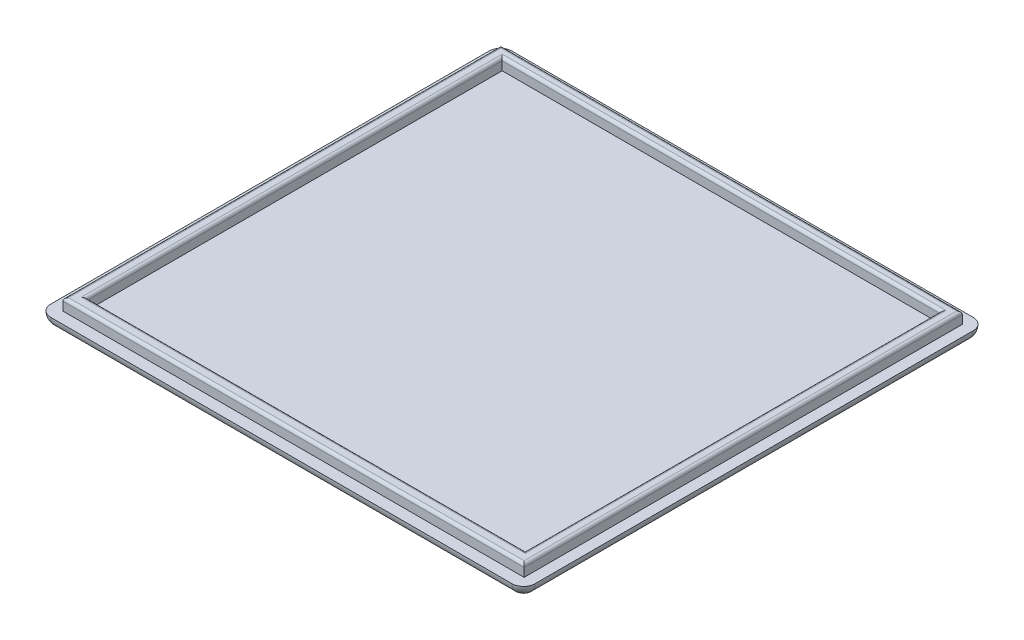
ISO-10303-21;
HEADER;
FILE_DESCRIPTION(('STEP AP214'),'2;1');
FILE_NAME('part.step','',(''),(''),'','','');
FILE_SCHEMA(('AUTOMOTIVE_DESIGN { 1 0 10303 214 1 1 1 1 }'));
ENDSEC;
DATA;
#1=APPLICATION_CONTEXT('core data for automotive mechanical design processes');
#2=APPLICATION_PROTOCOL_DEFINITION('international standard','automotive_design',2000,#1);
#3=PRODUCT_CONTEXT('',#1,'mechanical');
#4=PRODUCT('Part','Part','',(#3));
#5=PRODUCT_RELATED_PRODUCT_CATEGORY('part','',(#4));
#6=PRODUCT_DEFINITION_FORMATION('','',#4);
#7=PRODUCT_DEFINITION_CONTEXT('part definition',#1,'design');
#8=PRODUCT_DEFINITION('design','',#6,#7);
#9=PRODUCT_DEFINITION_SHAPE('','',#8);
#10=(LENGTH_UNIT() NAMED_UNIT(*) SI_UNIT(.MILLI.,.METRE.));
#11=(NAMED_UNIT(*) PLANE_ANGLE_UNIT() SI_UNIT($,.RADIAN.));
#12=(NAMED_UNIT(*) SI_UNIT($,.STERADIAN.) SOLID_ANGLE_UNIT());
#13=UNCERTAINTY_MEASURE_WITH_UNIT(LENGTH_MEASURE(1.E-05),#10,'distance_accuracy_value','');
#14=(GEOMETRIC_REPRESENTATION_CONTEXT(3) GLOBAL_UNCERTAINTY_ASSIGNED_CONTEXT((#13)) GLOBAL_UNIT_ASSIGNED_CONTEXT((#10,
#11,#12)) REPRESENTATION_CONTEXT('',''));
#15=CARTESIAN_POINT('',(0.,0.,0.));
#16=DIRECTION('',(0.,0.,1.));
#17=DIRECTION('',(1.,0.,0.));
#18=AXIS2_PLACEMENT_3D('',#15,#16,#17);
#19=CARTESIAN_POINT('',(0.,2.,0.));
#20=DIRECTION('',(0.,-1.,0.));
#21=DIRECTION('',(0.,0.,-1.));
#22=AXIS2_PLACEMENT_3D('',#19,#20,#21);
#23=PLANE('',#22);
#24=DIRECTION('',(0.,0.,-1.));
#25=VECTOR('',#24,1.);
#26=CARTESIAN_POINT('',(84.,2.,0.));
#27=LINE('',#26,#25);
#28=CARTESIAN_POINT('',(84.,2.,-2.));
#29=VERTEX_POINT('',#28);
#30=CARTESIAN_POINT('',(84.,2.,-78.));
#31=VERTEX_POINT('',#30);
#32=EDGE_CURVE('E249',#29,#31,#27,.T.);
#33=ORIENTED_EDGE('',*,*,#32,.T.);
#34=CARTESIAN_POINT('',(82.,2.,-78.));
#35=DIRECTION('',(0.,-1.,0.));
#36=DIRECTION('',(0.,0.,-1.));
#37=AXIS2_PLACEMENT_3D('',#34,#35,#36);
#38=CIRCLE('',#37,2.);
#39=CARTESIAN_POINT('',(82.,2.,-80.));
#40=VERTEX_POINT('',#39);
#41=EDGE_CURVE('E265',#31,#40,#38,.F.);
#42=ORIENTED_EDGE('',*,*,#41,.T.);
#43=DIRECTION('',(-1.,0.,0.));
#44=VECTOR('',#43,1.);
#45=CARTESIAN_POINT('',(0.,2.,-80.));
#46=LINE('',#45,#44);
#47=CARTESIAN_POINT('',(2.,2.,-80.));
#48=VERTEX_POINT('',#47);
#49=EDGE_CURVE('E252',#40,#48,#46,.T.);
#50=ORIENTED_EDGE('',*,*,#49,.T.);
#51=CARTESIAN_POINT('',(2.,2.,-78.));
#52=DIRECTION('',(0.,-1.,0.));
#53=DIRECTION('',(0.,0.,-1.));
#54=AXIS2_PLACEMENT_3D('',#51,#52,#53);
#55=CIRCLE('',#54,2.);
#56=CARTESIAN_POINT('',(0.,2.,-78.));
#57=VERTEX_POINT('',#56);
#58=EDGE_CURVE('E255',#48,#57,#55,.F.);
#59=ORIENTED_EDGE('',*,*,#58,.T.);
#60=DIRECTION('',(0.,0.,1.));
#61=VECTOR('',#60,1.);
#62=CARTESIAN_POINT('',(0.,2.,0.));
#63=LINE('',#62,#61);
#64=CARTESIAN_POINT('',(0.,2.,-2.));
#65=VERTEX_POINT('',#64);
#66=EDGE_CURVE('E243',#57,#65,#63,.T.);
#67=ORIENTED_EDGE('',*,*,#66,.T.);
#68=CARTESIAN_POINT('',(2.,2.,-2.));
#69=DIRECTION('',(0.,-1.,0.));
#70=DIRECTION('',(0.,0.,-1.));
#71=AXIS2_PLACEMENT_3D('',#68,#69,#70);
#72=CIRCLE('',#71,2.);
#73=CARTESIAN_POINT('',(2.,2.,0.));
#74=VERTEX_POINT('',#73);
#75=EDGE_CURVE('E258',#65,#74,#72,.F.);
#76=ORIENTED_EDGE('',*,*,#75,.T.);
#77=DIRECTION('',(1.,0.,0.));
#78=VECTOR('',#77,1.);
#79=CARTESIAN_POINT('',(0.,2.,0.));
#80=LINE('',#79,#78);
#81=CARTESIAN_POINT('',(82.,2.,0.));
#82=VERTEX_POINT('',#81);
#83=EDGE_CURVE('E246',#74,#82,#80,.T.);
#84=ORIENTED_EDGE('',*,*,#83,.T.);
#85=CARTESIAN_POINT('',(82.,2.,-2.));
#86=DIRECTION('',(0.,-1.,0.));
#87=DIRECTION('',(0.,0.,-1.));
#88=AXIS2_PLACEMENT_3D('',#85,#86,#87);
#89=CIRCLE('',#88,2.);
#90=EDGE_CURVE('E262',#82,#29,#89,.F.);
#91=ORIENTED_EDGE('',*,*,#90,.T.);
#92=EDGE_LOOP('',(#33,#42,#50,#59,#67,#76,#84,#91));
#93=FACE_BOUND('',#92,.T.);
#94=DIRECTION('',(1.,0.,0.));
#95=VECTOR('',#94,1.);
#96=CARTESIAN_POINT('',(0.,2.,-2.));
#97=LINE('',#96,#95);
#98=CARTESIAN_POINT('',(2.1,2.,-2.));
#99=VERTEX_POINT('',#98);
#100=CARTESIAN_POINT('',(82.1,2.,-2.));
#101=VERTEX_POINT('',#100);
#102=EDGE_CURVE('E181',#99,#101,#97,.T.);
#103=ORIENTED_EDGE('',*,*,#102,.F.);
#104=DIRECTION('',(0.,0.,1.));
#105=VECTOR('',#104,1.);
#106=CARTESIAN_POINT('',(2.1,2.,0.));
#107=LINE('',#106,#105);
#108=CARTESIAN_POINT('',(2.1,2.,-78.));
#109=VERTEX_POINT('',#108);
#110=EDGE_CURVE('E227',#109,#99,#107,.T.);
#111=ORIENTED_EDGE('',*,*,#110,.F.);
#112=DIRECTION('',(-1.,0.,0.));
#113=VECTOR('',#112,1.);
#114=CARTESIAN_POINT('',(0.,2.,-78.));
#115=LINE('',#114,#113);
#116=CARTESIAN_POINT('',(82.1,2.,-78.));
#117=VERTEX_POINT('',#116);
#118=EDGE_CURVE('E223',#117,#109,#115,.T.);
#119=ORIENTED_EDGE('',*,*,#118,.F.);
#120=DIRECTION('',(0.,0.,-1.));
#121=VECTOR('',#120,1.);
#122=CARTESIAN_POINT('',(82.1,2.,0.));
#123=LINE('',#122,#121);
#124=EDGE_CURVE('E219',#101,#117,#123,.T.);
#125=ORIENTED_EDGE('',*,*,#124,.F.);
#126=EDGE_LOOP('',(#103,#111,#119,#125));
#127=FACE_BOUND('',#126,.T.);
#128=ADVANCED_FACE('F41',(#93,#127),#23,.F.);
#129=CARTESIAN_POINT('',(0.,0.,0.));
#130=DIRECTION('',(0.,-1.,0.));
#131=DIRECTION('',(0.,0.,-1.));
#132=AXIS2_PLACEMENT_3D('',#129,#130,#131);
#133=PLANE('',#132);
#134=DIRECTION('',(-1.,0.,0.));
#135=VECTOR('',#134,1.);
#136=CARTESIAN_POINT('',(82.,0.,-78.));
#137=LINE('',#136,#135);
#138=CARTESIAN_POINT('',(2.,0.,-78.));
#139=VERTEX_POINT('',#138);
#140=CARTESIAN_POINT('',(82.,0.,-78.));
#141=VERTEX_POINT('',#140);
#142=EDGE_CURVE('E274',#139,#141,#137,.F.);
#143=ORIENTED_EDGE('',*,*,#142,.T.);
#144=DIRECTION('',(0.,0.,-1.));
#145=VECTOR('',#144,1.);
#146=CARTESIAN_POINT('',(82.,0.,-2.));
#147=LINE('',#146,#145);
#148=CARTESIAN_POINT('',(82.,0.,-2.));
#149=VERTEX_POINT('',#148);
#150=EDGE_CURVE('E277',#141,#149,#147,.F.);
#151=ORIENTED_EDGE('',*,*,#150,.T.);
#152=DIRECTION('',(1.,0.,0.));
#153=VECTOR('',#152,1.);
#154=CARTESIAN_POINT('',(2.,0.,-2.));
#155=LINE('',#154,#153);
#156=CARTESIAN_POINT('',(2.,0.,-2.));
#157=VERTEX_POINT('',#156);
#158=EDGE_CURVE('E268',#149,#157,#155,.F.);
#159=ORIENTED_EDGE('',*,*,#158,.T.);
#160=DIRECTION('',(0.,0.,1.));
#161=VECTOR('',#160,1.);
#162=CARTESIAN_POINT('',(2.,0.,-78.));
#163=LINE('',#162,#161);
#164=EDGE_CURVE('E271',#157,#139,#163,.F.);
#165=ORIENTED_EDGE('',*,*,#164,.T.);
#166=EDGE_LOOP('',(#143,#151,#159,#165));
#167=FACE_BOUND('',#166,.T.);
#168=ADVANCED_FACE('F408',(#167),#133,.T.);
#169=CARTESIAN_POINT('',(0.,4.,0.));
#170=DIRECTION('',(0.,1.,0.));
#171=DIRECTION('',(0.,0.,1.));
#172=AXIS2_PLACEMENT_3D('',#169,#170,#171);
#173=PLANE('',#172);
#174=DIRECTION('',(0.,0.,1.));
#175=VECTOR('',#174,1.);
#176=CARTESIAN_POINT('',(2.6,4.,-2.));
#177=LINE('',#176,#175);
#178=CARTESIAN_POINT('',(2.6,4.,-77.5));
#179=VERTEX_POINT('',#178);
#180=CARTESIAN_POINT('',(2.6,4.,-2.5));
#181=VERTEX_POINT('',#180);
#182=EDGE_CURVE('E321',#179,#181,#177,.T.);
#183=ORIENTED_EDGE('',*,*,#182,.T.);
#184=DIRECTION('',(1.,0.,0.));
#185=VECTOR('',#184,1.);
#186=CARTESIAN_POINT('',(82.1,4.,-2.5));
#187=LINE('',#186,#185);
#188=CARTESIAN_POINT('',(81.6,4.,-2.5));
#189=VERTEX_POINT('',#188);
#190=EDGE_CURVE('E330',#181,#189,#187,.T.);
#191=ORIENTED_EDGE('',*,*,#190,.T.);
#192=DIRECTION('',(0.,0.,-1.));
#193=VECTOR('',#192,1.);
#194=CARTESIAN_POINT('',(81.6,4.,-78.));
#195=LINE('',#194,#193);
#196=CARTESIAN_POINT('',(81.6,4.,-77.5));
#197=VERTEX_POINT('',#196);
#198=EDGE_CURVE('E327',#189,#197,#195,.T.);
#199=ORIENTED_EDGE('',*,*,#198,.T.);
#200=DIRECTION('',(-1.,0.,0.));
#201=VECTOR('',#200,1.);
#202=CARTESIAN_POINT('',(2.1,4.,-77.5));
#203=LINE('',#202,#201);
#204=EDGE_CURVE('E324',#197,#179,#203,.T.);
#205=ORIENTED_EDGE('',*,*,#204,.T.);
#206=EDGE_LOOP('',(#183,#191,#199,#205));
#207=FACE_BOUND('',#206,.T.);
#208=DIRECTION('',(0.,0.,-1.));
#209=VECTOR('',#208,1.);
#210=CARTESIAN_POINT('',(80.6061346638942,4.,0.));
#211=LINE('',#210,#209);
#212=CARTESIAN_POINT('',(80.6061346638942,4.,-76.6904761904762));
#213=VERTEX_POINT('',#212);
#214=CARTESIAN_POINT('',(80.6061346638942,4.,-3.69047619047621));
#215=VERTEX_POINT('',#214);
#216=EDGE_CURVE('E314',#213,#215,#211,.F.);
#217=ORIENTED_EDGE('',*,*,#216,.T.);
#218=DIRECTION('',(1.,0.,0.));
#219=VECTOR('',#218,1.);
#220=CARTESIAN_POINT('',(0.,4.,-3.69047619047621));
#221=LINE('',#220,#219);
#222=CARTESIAN_POINT('',(3.60613466389421,4.,-3.69047619047621));
#223=VERTEX_POINT('',#222);
#224=EDGE_CURVE('E317',#215,#223,#221,.F.);
#225=ORIENTED_EDGE('',*,*,#224,.T.);
#226=DIRECTION('',(0.,0.,1.));
#227=VECTOR('',#226,1.);
#228=CARTESIAN_POINT('',(3.60613466389421,4.,0.));
#229=LINE('',#228,#227);
#230=CARTESIAN_POINT('',(3.60613466389421,4.,-76.6904761904762));
#231=VERTEX_POINT('',#230);
#232=EDGE_CURVE('E281',#223,#231,#229,.F.);
#233=ORIENTED_EDGE('',*,*,#232,.T.);
#234=DIRECTION('',(-1.,0.,0.));
#235=VECTOR('',#234,1.);
#236=CARTESIAN_POINT('',(0.,4.,-76.6904761904762));
#237=LINE('',#236,#235);
#238=EDGE_CURVE('E311',#231,#213,#237,.F.);
#239=ORIENTED_EDGE('',*,*,#238,.T.);
#240=EDGE_LOOP('',(#217,#225,#233,#239));
#241=FACE_BOUND('',#240,.T.);
#242=ADVANCED_FACE('F389',(#207,#241),#173,.T.);
#243=CARTESIAN_POINT('',(0.,4.,-2.));
#244=DIRECTION('',(0.,0.,-1.));
#245=DIRECTION('',(-1.,0.,0.));
#246=AXIS2_PLACEMENT_3D('',#243,#244,#245);
#247=PLANE('',#246);
#248=DIRECTION('',(0.,-1.,0.));
#249=VECTOR('',#248,1.);
#250=CARTESIAN_POINT('',(82.1,4.,-2.));
#251=LINE('',#250,#249);
#252=CARTESIAN_POINT('',(82.1,3.5,-2.));
#253=VERTEX_POINT('',#252);
#254=EDGE_CURVE('E240',#253,#101,#251,.T.);
#255=ORIENTED_EDGE('',*,*,#254,.F.);
#256=DIRECTION('',(1.,0.,0.));
#257=VECTOR('',#256,1.);
#258=CARTESIAN_POINT('',(2.1,3.5,-2.));
#259=LINE('',#258,#257);
#260=CARTESIAN_POINT('',(2.1,3.5,-2.));
#261=VERTEX_POINT('',#260);
#262=EDGE_CURVE('E334',#253,#261,#259,.F.);
#263=ORIENTED_EDGE('',*,*,#262,.T.);
#264=DIRECTION('',(0.,-1.,0.));
#265=VECTOR('',#264,1.);
#266=CARTESIAN_POINT('',(2.1,4.,-2.));
#267=LINE('',#266,#265);
#268=EDGE_CURVE('E231',#261,#99,#267,.T.);
#269=ORIENTED_EDGE('',*,*,#268,.T.);
#270=ORIENTED_EDGE('',*,*,#102,.T.);
#271=EDGE_LOOP('',(#255,#263,#269,#270));
#272=FACE_BOUND('',#271,.T.);
#273=ADVANCED_FACE('F417',(#272),#247,.F.);
#274=CARTESIAN_POINT('',(82.1,4.,0.));
#275=DIRECTION('',(-1.,0.,0.));
#276=DIRECTION('',(0.,0.,1.));
#277=AXIS2_PLACEMENT_3D('',#274,#275,#276);
#278=PLANE('',#277);
#279=DIRECTION('',(0.,-1.,0.));
#280=VECTOR('',#279,1.);
#281=CARTESIAN_POINT('',(82.1,4.,-78.));
#282=LINE('',#281,#280);
#283=CARTESIAN_POINT('',(82.1,3.5,-78.));
#284=VERTEX_POINT('',#283);
#285=EDGE_CURVE('E237',#284,#117,#282,.T.);
#286=ORIENTED_EDGE('',*,*,#285,.F.);
#287=DIRECTION('',(0.,0.,-1.));
#288=VECTOR('',#287,1.);
#289=CARTESIAN_POINT('',(82.1,3.5,-2.));
#290=LINE('',#289,#288);
#291=EDGE_CURVE('E343',#284,#253,#290,.F.);
#292=ORIENTED_EDGE('',*,*,#291,.T.);
#293=ORIENTED_EDGE('',*,*,#254,.T.);
#294=ORIENTED_EDGE('',*,*,#124,.T.);
#295=EDGE_LOOP('',(#286,#292,#293,#294));
#296=FACE_BOUND('',#295,.T.);
#297=ADVANCED_FACE('F553',(#296),#278,.F.);
#298=CARTESIAN_POINT('',(0.,4.,-78.));
#299=DIRECTION('',(0.,0.,1.));
#300=DIRECTION('',(1.,0.,0.));
#301=AXIS2_PLACEMENT_3D('',#298,#299,#300);
#302=PLANE('',#301);
#303=DIRECTION('',(0.,-1.,0.));
#304=VECTOR('',#303,1.);
#305=CARTESIAN_POINT('',(2.1,4.,-78.));
#306=LINE('',#305,#304);
#307=CARTESIAN_POINT('',(2.1,3.5,-78.));
#308=VERTEX_POINT('',#307);
#309=EDGE_CURVE('E234',#308,#109,#306,.T.);
#310=ORIENTED_EDGE('',*,*,#309,.F.);
#311=DIRECTION('',(-1.,0.,0.));
#312=VECTOR('',#311,1.);
#313=CARTESIAN_POINT('',(82.1,3.5,-78.));
#314=LINE('',#313,#312);
#315=EDGE_CURVE('E348',#308,#284,#314,.F.);
#316=ORIENTED_EDGE('',*,*,#315,.T.);
#317=ORIENTED_EDGE('',*,*,#285,.T.);
#318=ORIENTED_EDGE('',*,*,#118,.T.);
#319=EDGE_LOOP('',(#310,#316,#317,#318));
#320=FACE_BOUND('',#319,.T.);
#321=ADVANCED_FACE('F560',(#320),#302,.F.);
#322=CARTESIAN_POINT('',(2.1,4.,0.));
#323=DIRECTION('',(1.,0.,0.));
#324=DIRECTION('',(0.,0.,-1.));
#325=AXIS2_PLACEMENT_3D('',#322,#323,#324);
#326=PLANE('',#325);
#327=ORIENTED_EDGE('',*,*,#268,.F.);
#328=DIRECTION('',(0.,0.,1.));
#329=VECTOR('',#328,1.);
#330=CARTESIAN_POINT('',(2.1,3.5,-78.));
#331=LINE('',#330,#329);
#332=EDGE_CURVE('E51',#261,#308,#331,.F.);
#333=ORIENTED_EDGE('',*,*,#332,.T.);
#334=ORIENTED_EDGE('',*,*,#309,.T.);
#335=ORIENTED_EDGE('',*,*,#110,.T.);
#336=EDGE_LOOP('',(#327,#333,#334,#335));
#337=FACE_BOUND('',#336,.T.);
#338=ADVANCED_FACE('F567',(#337),#326,.F.);
#339=CARTESIAN_POINT('',(0.,4.,-4.19047619047621));
#340=DIRECTION('',(0.,0.,-1.));
#341=DIRECTION('',(-1.,0.,0.));
#342=AXIS2_PLACEMENT_3D('',#339,#340,#341);
#343=PLANE('',#342);
#344=DIRECTION('',(0.,-1.,0.));
#345=VECTOR('',#344,1.);
#346=CARTESIAN_POINT('',(4.10613466389421,4.,-4.19047619047622));
#347=LINE('',#346,#345);
#348=CARTESIAN_POINT('',(4.10613466389421,3.5,-4.19047619047622));
#349=VERTEX_POINT('',#348);
#350=CARTESIAN_POINT('',(4.10613466389421,2.,-4.19047619047622));
#351=VERTEX_POINT('',#350);
#352=EDGE_CURVE('E208',#349,#351,#347,.T.);
#353=ORIENTED_EDGE('',*,*,#352,.F.);
#354=DIRECTION('',(1.,0.,0.));
#355=VECTOR('',#354,1.);
#356=CARTESIAN_POINT('',(0.,3.5,-4.19047619047621));
#357=LINE('',#356,#355);
#358=CARTESIAN_POINT('',(80.1061346638942,3.5,-4.19047619047621));
#359=VERTEX_POINT('',#358);
#360=EDGE_CURVE('E178',#349,#359,#357,.T.);
#361=ORIENTED_EDGE('',*,*,#360,.T.);
#362=DIRECTION('',(0.,-1.,0.));
#363=VECTOR('',#362,1.);
#364=CARTESIAN_POINT('',(80.1061346638942,4.,-4.19047619047621));
#365=LINE('',#364,#363);
#366=CARTESIAN_POINT('',(80.1061346638942,2.,-4.19047619047621));
#367=VERTEX_POINT('',#366);
#368=EDGE_CURVE('E170',#359,#367,#365,.T.);
#369=ORIENTED_EDGE('',*,*,#368,.T.);
#370=DIRECTION('',(1.,0.,0.));
#371=VECTOR('',#370,1.);
#372=CARTESIAN_POINT('',(0.,2.,-4.19047619047621));
#373=LINE('',#372,#371);
#374=EDGE_CURVE('E175',#351,#367,#373,.T.);
#375=ORIENTED_EDGE('',*,*,#374,.F.);
#376=EDGE_LOOP('',(#353,#361,#369,#375));
#377=FACE_BOUND('',#376,.T.);
#378=ADVANCED_FACE('F173',(#377),#343,.T.);
#379=CARTESIAN_POINT('',(80.1061346638942,4.,0.));
#380=DIRECTION('',(-1.,0.,0.));
#381=DIRECTION('',(0.,0.,1.));
#382=AXIS2_PLACEMENT_3D('',#379,#380,#381);
#383=PLANE('',#382);
#384=ORIENTED_EDGE('',*,*,#368,.F.);
#385=DIRECTION('',(0.,0.,-1.));
#386=VECTOR('',#385,1.);
#387=CARTESIAN_POINT('',(80.1061346638942,3.5,0.));
#388=LINE('',#387,#386);
#389=CARTESIAN_POINT('',(80.1061346638942,3.5,-76.1904761904762));
#390=VERTEX_POINT('',#389);
#391=EDGE_CURVE('E340',#359,#390,#388,.T.);
#392=ORIENTED_EDGE('',*,*,#391,.T.);
#393=DIRECTION('',(0.,-1.,0.));
#394=VECTOR('',#393,1.);
#395=CARTESIAN_POINT('',(80.1061346638942,4.,-76.1904761904762));
#396=LINE('',#395,#394);
#397=CARTESIAN_POINT('',(80.1061346638942,2.,-76.1904761904762));
#398=VERTEX_POINT('',#397);
#399=EDGE_CURVE('E182',#390,#398,#396,.T.);
#400=ORIENTED_EDGE('',*,*,#399,.T.);
#401=DIRECTION('',(0.,0.,-1.));
#402=VECTOR('',#401,1.);
#403=CARTESIAN_POINT('',(80.1061346638942,2.,0.));
#404=LINE('',#403,#402);
#405=EDGE_CURVE('E185',#367,#398,#404,.T.);
#406=ORIENTED_EDGE('',*,*,#405,.F.);
#407=EDGE_LOOP('',(#384,#392,#400,#406));
#408=FACE_BOUND('',#407,.T.);
#409=ADVANCED_FACE('F186',(#408),#383,.T.);
#410=CARTESIAN_POINT('',(0.,4.,-76.1904761904762));
#411=DIRECTION('',(0.,0.,1.));
#412=DIRECTION('',(1.,0.,0.));
#413=AXIS2_PLACEMENT_3D('',#410,#411,#412);
#414=PLANE('',#413);
#415=ORIENTED_EDGE('',*,*,#399,.F.);
#416=DIRECTION('',(-1.,0.,0.));
#417=VECTOR('',#416,1.);
#418=CARTESIAN_POINT('',(0.,3.5,-76.1904761904762));
#419=LINE('',#418,#417);
#420=CARTESIAN_POINT('',(4.10613466389421,3.5,-76.1904761904762));
#421=VERTEX_POINT('',#420);
#422=EDGE_CURVE('E66',#390,#421,#419,.T.);
#423=ORIENTED_EDGE('',*,*,#422,.T.);
#424=DIRECTION('',(0.,-1.,0.));
#425=VECTOR('',#424,1.);
#426=CARTESIAN_POINT('',(4.10613466389421,4.,-76.1904761904762));
#427=LINE('',#426,#425);
#428=CARTESIAN_POINT('',(4.10613466389421,2.,-76.1904761904762));
#429=VERTEX_POINT('',#428);
#430=EDGE_CURVE('E211',#421,#429,#427,.T.);
#431=ORIENTED_EDGE('',*,*,#430,.T.);
#432=DIRECTION('',(-1.,0.,0.));
#433=VECTOR('',#432,1.);
#434=CARTESIAN_POINT('',(0.,2.,-76.1904761904762));
#435=LINE('',#434,#433);
#436=EDGE_CURVE('E191',#398,#429,#435,.T.);
#437=ORIENTED_EDGE('',*,*,#436,.F.);
#438=EDGE_LOOP('',(#415,#423,#431,#437));
#439=FACE_BOUND('',#438,.T.);
#440=ADVANCED_FACE('F395',(#439),#414,.T.);
#441=CARTESIAN_POINT('',(4.10613466389421,4.,0.));
#442=DIRECTION('',(1.,0.,0.));
#443=DIRECTION('',(0.,0.,-1.));
#444=AXIS2_PLACEMENT_3D('',#441,#442,#443);
#445=PLANE('',#444);
#446=ORIENTED_EDGE('',*,*,#430,.F.);
#447=DIRECTION('',(0.,0.,1.));
#448=VECTOR('',#447,1.);
#449=CARTESIAN_POINT('',(4.10613466389421,3.5,0.));
#450=LINE('',#449,#448);
#451=EDGE_CURVE('E11',#421,#349,#450,.T.);
#452=ORIENTED_EDGE('',*,*,#451,.T.);
#453=ORIENTED_EDGE('',*,*,#352,.T.);
#454=DIRECTION('',(0.,0.,1.));
#455=VECTOR('',#454,1.);
#456=CARTESIAN_POINT('',(4.10613466389421,2.,0.));
#457=LINE('',#456,#455);
#458=EDGE_CURVE('E195',#429,#351,#457,.T.);
#459=ORIENTED_EDGE('',*,*,#458,.F.);
#460=EDGE_LOOP('',(#446,#452,#453,#459));
#461=FACE_BOUND('',#460,.T.);
#462=ADVANCED_FACE('F397',(#461),#445,.T.);
#463=ORIENTED_EDGE('',*,*,#458,.T.);
#464=ORIENTED_EDGE('',*,*,#374,.T.);
#465=ORIENTED_EDGE('',*,*,#405,.T.);
#466=ORIENTED_EDGE('',*,*,#436,.T.);
#467=EDGE_LOOP('',(#463,#464,#465,#466));
#468=FACE_BOUND('',#467,.T.);
#469=ADVANCED_FACE('F193',(#468),#23,.F.);
#470=CARTESIAN_POINT('',(82.,2.,-78.));
#471=DIRECTION('',(0.,-1.,0.));
#472=DIRECTION('',(0.,0.,-1.));
#473=AXIS2_PLACEMENT_3D('',#470,#471,#472);
#474=SPHERICAL_SURFACE('',#473,2.);
#475=CARTESIAN_POINT('',(82.,2.,-78.));
#476=DIRECTION('',(-1.,0.,0.));
#477=DIRECTION('',(0.,0.,1.));
#478=AXIS2_PLACEMENT_3D('',#475,#476,#477);
#479=CIRCLE('',#478,2.);
#480=EDGE_CURVE('E201',#40,#141,#479,.T.);
#481=ORIENTED_EDGE('',*,*,#480,.F.);
#482=ORIENTED_EDGE('',*,*,#41,.F.);
#483=CARTESIAN_POINT('',(82.,2.,-78.));
#484=DIRECTION('',(0.,0.,1.));
#485=DIRECTION('',(1.,0.,0.));
#486=AXIS2_PLACEMENT_3D('',#483,#484,#485);
#487=CIRCLE('',#486,2.);
#488=EDGE_CURVE('E197',#141,#31,#487,.T.);
#489=ORIENTED_EDGE('',*,*,#488,.F.);
#490=EDGE_LOOP('',(#481,#482,#489));
#491=FACE_BOUND('',#490,.T.);
#492=ADVANCED_FACE('F404',(#491),#474,.T.);
#493=CARTESIAN_POINT('',(82.,2.,0.));
#494=DIRECTION('',(0.,0.,1.));
#495=DIRECTION('',(1.,0.,0.));
#496=AXIS2_PLACEMENT_3D('',#493,#494,#495);
#497=CYLINDRICAL_SURFACE('',#496,2.);
#498=ORIENTED_EDGE('',*,*,#488,.T.);
#499=ORIENTED_EDGE('',*,*,#32,.F.);
#500=CARTESIAN_POINT('',(82.,2.,-2.));
#501=DIRECTION('',(0.,0.,1.));
#502=DIRECTION('',(1.,0.,0.));
#503=AXIS2_PLACEMENT_3D('',#500,#501,#502);
#504=CIRCLE('',#503,2.);
#505=EDGE_CURVE('E302',#149,#29,#504,.T.);
#506=ORIENTED_EDGE('',*,*,#505,.F.);
#507=ORIENTED_EDGE('',*,*,#150,.F.);
#508=EDGE_LOOP('',(#498,#499,#506,#507));
#509=FACE_BOUND('',#508,.T.);
#510=ADVANCED_FACE('F444',(#509),#497,.T.);
#511=CARTESIAN_POINT('',(0.,2.,-78.));
#512=DIRECTION('',(1.,0.,0.));
#513=DIRECTION('',(0.,0.,-1.));
#514=AXIS2_PLACEMENT_3D('',#511,#512,#513);
#515=CYLINDRICAL_SURFACE('',#514,2.);
#516=ORIENTED_EDGE('',*,*,#480,.T.);
#517=ORIENTED_EDGE('',*,*,#142,.F.);
#518=CARTESIAN_POINT('',(2.,2.,-78.));
#519=DIRECTION('',(-1.,0.,0.));
#520=DIRECTION('',(0.,0.,1.));
#521=AXIS2_PLACEMENT_3D('',#518,#519,#520);
#522=CIRCLE('',#521,2.);
#523=EDGE_CURVE('E298',#48,#139,#522,.T.);
#524=ORIENTED_EDGE('',*,*,#523,.F.);
#525=ORIENTED_EDGE('',*,*,#49,.F.);
#526=EDGE_LOOP('',(#516,#517,#524,#525));
#527=FACE_BOUND('',#526,.T.);
#528=ADVANCED_FACE('F440',(#527),#515,.T.);
#529=CARTESIAN_POINT('',(82.,2.,-2.));
#530=DIRECTION('',(0.,-1.,0.));
#531=DIRECTION('',(0.,0.,-1.));
#532=AXIS2_PLACEMENT_3D('',#529,#530,#531);
#533=SPHERICAL_SURFACE('',#532,2.);
#534=ORIENTED_EDGE('',*,*,#505,.T.);
#535=ORIENTED_EDGE('',*,*,#90,.F.);
#536=CARTESIAN_POINT('',(82.,2.,-2.));
#537=DIRECTION('',(-1.,0.,0.));
#538=DIRECTION('',(0.,0.,1.));
#539=AXIS2_PLACEMENT_3D('',#536,#537,#538);
#540=CIRCLE('',#539,2.);
#541=EDGE_CURVE('E294',#149,#82,#540,.T.);
#542=ORIENTED_EDGE('',*,*,#541,.F.);
#543=EDGE_LOOP('',(#534,#535,#542));
#544=FACE_BOUND('',#543,.T.);
#545=ADVANCED_FACE('F436',(#544),#533,.T.);
#546=CARTESIAN_POINT('',(2.,2.,-78.));
#547=DIRECTION('',(0.,-1.,0.));
#548=DIRECTION('',(0.,0.,-1.));
#549=AXIS2_PLACEMENT_3D('',#546,#547,#548);
#550=SPHERICAL_SURFACE('',#549,2.);
#551=ORIENTED_EDGE('',*,*,#58,.F.);
#552=ORIENTED_EDGE('',*,*,#523,.T.);
#553=CARTESIAN_POINT('',(2.,2.,-78.));
#554=DIRECTION('',(0.,0.,1.));
#555=DIRECTION('',(1.,0.,0.));
#556=AXIS2_PLACEMENT_3D('',#553,#554,#555);
#557=CIRCLE('',#556,2.);
#558=EDGE_CURVE('E290',#57,#139,#557,.T.);
#559=ORIENTED_EDGE('',*,*,#558,.F.);
#560=EDGE_LOOP('',(#551,#552,#559));
#561=FACE_BOUND('',#560,.T.);
#562=ADVANCED_FACE('F432',(#561),#550,.T.);
#563=CARTESIAN_POINT('',(0.,2.,-2.));
#564=DIRECTION('',(-1.,0.,0.));
#565=DIRECTION('',(0.,0.,1.));
#566=AXIS2_PLACEMENT_3D('',#563,#564,#565);
#567=CYLINDRICAL_SURFACE('',#566,2.);
#568=ORIENTED_EDGE('',*,*,#541,.T.);
#569=ORIENTED_EDGE('',*,*,#83,.F.);
#570=CARTESIAN_POINT('',(2.,2.,-2.));
#571=DIRECTION('',(-1.,0.,0.));
#572=DIRECTION('',(0.,0.,1.));
#573=AXIS2_PLACEMENT_3D('',#570,#571,#572);
#574=CIRCLE('',#573,2.);
#575=EDGE_CURVE('E286',#157,#74,#574,.T.);
#576=ORIENTED_EDGE('',*,*,#575,.F.);
#577=ORIENTED_EDGE('',*,*,#158,.F.);
#578=EDGE_LOOP('',(#568,#569,#576,#577));
#579=FACE_BOUND('',#578,.T.);
#580=ADVANCED_FACE('F428',(#579),#567,.T.);
#581=CARTESIAN_POINT('',(2.,2.,0.));
#582=DIRECTION('',(0.,0.,-1.));
#583=DIRECTION('',(-1.,0.,0.));
#584=AXIS2_PLACEMENT_3D('',#581,#582,#583);
#585=CYLINDRICAL_SURFACE('',#584,2.);
#586=ORIENTED_EDGE('',*,*,#558,.T.);
#587=ORIENTED_EDGE('',*,*,#164,.F.);
#588=CARTESIAN_POINT('',(2.,2.,-2.));
#589=DIRECTION('',(0.,0.,1.));
#590=DIRECTION('',(1.,0.,0.));
#591=AXIS2_PLACEMENT_3D('',#588,#589,#590);
#592=CIRCLE('',#591,2.);
#593=EDGE_CURVE('E282',#65,#157,#592,.T.);
#594=ORIENTED_EDGE('',*,*,#593,.F.);
#595=ORIENTED_EDGE('',*,*,#66,.F.);
#596=EDGE_LOOP('',(#586,#587,#594,#595));
#597=FACE_BOUND('',#596,.T.);
#598=ADVANCED_FACE('F424',(#597),#585,.T.);
#599=CARTESIAN_POINT('',(2.,2.,-2.));
#600=DIRECTION('',(0.,-1.,0.));
#601=DIRECTION('',(0.,0.,-1.));
#602=AXIS2_PLACEMENT_3D('',#599,#600,#601);
#603=SPHERICAL_SURFACE('',#602,2.);
#604=ORIENTED_EDGE('',*,*,#575,.T.);
#605=ORIENTED_EDGE('',*,*,#75,.F.);
#606=ORIENTED_EDGE('',*,*,#593,.T.);
#607=EDGE_LOOP('',(#604,#605,#606));
#608=FACE_BOUND('',#607,.T.);
#609=ADVANCED_FACE('F420',(#608),#603,.T.);
#610=CARTESIAN_POINT('',(0.,3.5,-77.5));
#611=DIRECTION('',(1.,0.,0.));
#612=DIRECTION('',(0.,0.,-1.));
#613=AXIS2_PLACEMENT_3D('',#610,#611,#612);
#614=CYLINDRICAL_SURFACE('',#613,0.5);
#615=CARTESIAN_POINT('',(81.6,3.5,-77.5));
#616=DIRECTION('',(0.707106781186547,0.,0.707106781186548));
#617=DIRECTION('',(0.707106781186548,0.,-0.707106781186547));
#618=AXIS2_PLACEMENT_3D('',#615,#616,#617);
#619=ELLIPSE('',#618,0.707106781186547,0.5);
#620=EDGE_CURVE('E359',#284,#197,#619,.T.);
#621=ORIENTED_EDGE('',*,*,#620,.F.);
#622=ORIENTED_EDGE('',*,*,#315,.F.);
#623=CARTESIAN_POINT('',(2.6,3.5,-77.5));
#624=DIRECTION('',(0.707106781186548,0.,-0.707106781186547));
#625=DIRECTION('',(-0.707106781186547,0.,-0.707106781186548));
#626=AXIS2_PLACEMENT_3D('',#623,#624,#625);
#627=ELLIPSE('',#626,0.707106781186548,0.5);
#628=EDGE_CURVE('E287',#179,#308,#627,.F.);
#629=ORIENTED_EDGE('',*,*,#628,.F.);
#630=ORIENTED_EDGE('',*,*,#204,.F.);
#631=EDGE_LOOP('',(#621,#622,#629,#630));
#632=FACE_BOUND('',#631,.T.);
#633=ADVANCED_FACE('F423',(#632),#614,.T.);
#634=CARTESIAN_POINT('',(2.6,3.5,0.));
#635=DIRECTION('',(0.,0.,-1.));
#636=DIRECTION('',(-1.,0.,0.));
#637=AXIS2_PLACEMENT_3D('',#634,#635,#636);
#638=CYLINDRICAL_SURFACE('',#637,0.5);
#639=ORIENTED_EDGE('',*,*,#628,.T.);
#640=ORIENTED_EDGE('',*,*,#332,.F.);
#641=CARTESIAN_POINT('',(2.6,3.5,-2.5));
#642=DIRECTION('',(-0.707106781186547,0.,-0.707106781186547));
#643=DIRECTION('',(0.707106781186547,0.,-0.707106781186547));
#644=AXIS2_PLACEMENT_3D('',#641,#642,#643);
#645=ELLIPSE('',#644,0.707106781186547,0.5);
#646=EDGE_CURVE('E356',#181,#261,#645,.F.);
#647=ORIENTED_EDGE('',*,*,#646,.F.);
#648=ORIENTED_EDGE('',*,*,#182,.F.);
#649=EDGE_LOOP('',(#639,#640,#647,#648));
#650=FACE_BOUND('',#649,.T.);
#651=ADVANCED_FACE('F459',(#650),#638,.T.);
#652=CARTESIAN_POINT('',(81.6,3.5,0.));
#653=DIRECTION('',(0.,0.,1.));
#654=DIRECTION('',(1.,0.,0.));
#655=AXIS2_PLACEMENT_3D('',#652,#653,#654);
#656=CYLINDRICAL_SURFACE('',#655,0.5);
#657=ORIENTED_EDGE('',*,*,#620,.T.);
#658=ORIENTED_EDGE('',*,*,#198,.F.);
#659=CARTESIAN_POINT('',(81.6,3.5,-2.5));
#660=DIRECTION('',(-0.707106781186547,0.,0.707106781186547));
#661=DIRECTION('',(0.707106781186547,0.,0.707106781186547));
#662=AXIS2_PLACEMENT_3D('',#659,#660,#661);
#663=ELLIPSE('',#662,0.707106781186547,0.5);
#664=EDGE_CURVE('E353',#253,#189,#663,.T.);
#665=ORIENTED_EDGE('',*,*,#664,.F.);
#666=ORIENTED_EDGE('',*,*,#291,.F.);
#667=EDGE_LOOP('',(#657,#658,#665,#666));
#668=FACE_BOUND('',#667,.T.);
#669=ADVANCED_FACE('F455',(#668),#656,.T.);
#670=CARTESIAN_POINT('',(0.,3.5,-2.5));
#671=DIRECTION('',(-1.,0.,0.));
#672=DIRECTION('',(0.,0.,1.));
#673=AXIS2_PLACEMENT_3D('',#670,#671,#672);
#674=CYLINDRICAL_SURFACE('',#673,0.5);
#675=ORIENTED_EDGE('',*,*,#646,.T.);
#676=ORIENTED_EDGE('',*,*,#262,.F.);
#677=ORIENTED_EDGE('',*,*,#664,.T.);
#678=ORIENTED_EDGE('',*,*,#190,.F.);
#679=EDGE_LOOP('',(#675,#676,#677,#678));
#680=FACE_BOUND('',#679,.T.);
#681=ADVANCED_FACE('F452',(#680),#674,.T.);
#682=CARTESIAN_POINT('',(0.,3.5,-76.6904761904762));
#683=DIRECTION('',(-1.,0.,0.));
#684=DIRECTION('',(0.,0.,1.));
#685=AXIS2_PLACEMENT_3D('',#682,#683,#684);
#686=CYLINDRICAL_SURFACE('',#685,0.5);
#687=CARTESIAN_POINT('',(80.6061346638942,3.5,-76.6904761904762));
#688=DIRECTION('',(-0.707106781186547,0.,-0.707106781186547));
#689=DIRECTION('',(0.707106781186547,0.,-0.707106781186547));
#690=AXIS2_PLACEMENT_3D('',#687,#688,#689);
#691=ELLIPSE('',#690,0.707106781186547,0.5);
#692=EDGE_CURVE('E371',#213,#390,#691,.F.);
#693=ORIENTED_EDGE('',*,*,#692,.F.);
#694=ORIENTED_EDGE('',*,*,#238,.F.);
#695=CARTESIAN_POINT('',(3.60613466389421,3.5,-76.6904761904762));
#696=DIRECTION('',(-0.707106781186547,0.,0.707106781186547));
#697=DIRECTION('',(-0.707106781186547,0.,-0.707106781186547));
#698=AXIS2_PLACEMENT_3D('',#695,#696,#697);
#699=ELLIPSE('',#698,0.707106781186547,0.5);
#700=EDGE_CURVE('E45',#421,#231,#699,.T.);
#701=ORIENTED_EDGE('',*,*,#700,.F.);
#702=ORIENTED_EDGE('',*,*,#422,.F.);
#703=EDGE_LOOP('',(#693,#694,#701,#702));
#704=FACE_BOUND('',#703,.T.);
#705=ADVANCED_FACE('F43',(#704),#686,.T.);
#706=CARTESIAN_POINT('',(3.60613466389421,3.5,0.));
#707=DIRECTION('',(0.,0.,1.));
#708=DIRECTION('',(1.,0.,0.));
#709=AXIS2_PLACEMENT_3D('',#706,#707,#708);
#710=CYLINDRICAL_SURFACE('',#709,0.5);
#711=ORIENTED_EDGE('',*,*,#700,.T.);
#712=ORIENTED_EDGE('',*,*,#232,.F.);
#713=CARTESIAN_POINT('',(3.60613466389421,3.5,-3.69047619047621));
#714=DIRECTION('',(0.707106781186547,0.,0.707106781186547));
#715=DIRECTION('',(0.707106781186547,0.,-0.707106781186547));
#716=AXIS2_PLACEMENT_3D('',#713,#714,#715);
#717=ELLIPSE('',#716,0.707106781186547,0.5);
#718=EDGE_CURVE('E369',#349,#223,#717,.T.);
#719=ORIENTED_EDGE('',*,*,#718,.F.);
#720=ORIENTED_EDGE('',*,*,#451,.F.);
#721=EDGE_LOOP('',(#711,#712,#719,#720));
#722=FACE_BOUND('',#721,.T.);
#723=ADVANCED_FACE('F384',(#722),#710,.T.);
#724=CARTESIAN_POINT('',(80.6061346638942,3.5,0.));
#725=DIRECTION('',(0.,0.,-1.));
#726=DIRECTION('',(-1.,0.,0.));
#727=AXIS2_PLACEMENT_3D('',#724,#725,#726);
#728=CYLINDRICAL_SURFACE('',#727,0.5);
#729=ORIENTED_EDGE('',*,*,#692,.T.);
#730=ORIENTED_EDGE('',*,*,#391,.F.);
#731=CARTESIAN_POINT('',(80.6061346638942,3.5,-3.69047619047621));
#732=DIRECTION('',(0.707106781186547,0.,-0.707106781186547));
#733=DIRECTION('',(0.707106781186547,0.,0.707106781186547));
#734=AXIS2_PLACEMENT_3D('',#731,#732,#733);
#735=ELLIPSE('',#734,0.707106781186547,0.5);
#736=EDGE_CURVE('E366',#215,#359,#735,.F.);
#737=ORIENTED_EDGE('',*,*,#736,.F.);
#738=ORIENTED_EDGE('',*,*,#216,.F.);
#739=EDGE_LOOP('',(#729,#730,#737,#738));
#740=FACE_BOUND('',#739,.T.);
#741=ADVANCED_FACE('F394',(#740),#728,.T.);
#742=CARTESIAN_POINT('',(0.,3.5,-3.69047619047621));
#743=DIRECTION('',(1.,0.,0.));
#744=DIRECTION('',(0.,0.,-1.));
#745=AXIS2_PLACEMENT_3D('',#742,#743,#744);
#746=CYLINDRICAL_SURFACE('',#745,0.5);
#747=ORIENTED_EDGE('',*,*,#718,.T.);
#748=ORIENTED_EDGE('',*,*,#224,.F.);
#749=ORIENTED_EDGE('',*,*,#736,.T.);
#750=ORIENTED_EDGE('',*,*,#360,.F.);
#751=EDGE_LOOP('',(#747,#748,#749,#750));
#752=FACE_BOUND('',#751,.T.);
#753=ADVANCED_FACE('F393',(#752),#746,.T.);
#754=CLOSED_SHELL('',(#128,#168,#242,#273,#297,#321,#338,#378,#409,#440,#462,#469,#492,#510,
#528,#545,#562,#580,#598,#609,#633,#651,#669,#681,#705,#723,#741,#753));
#755=MANIFOLD_SOLID_BREP('B2',#754);
#756=ADVANCED_BREP_SHAPE_REPRESENTATION('',(#18,#755),#14);
#757=SHAPE_DEFINITION_REPRESENTATION(#9,#756);
ENDSEC;
END-ISO-10303-21;
